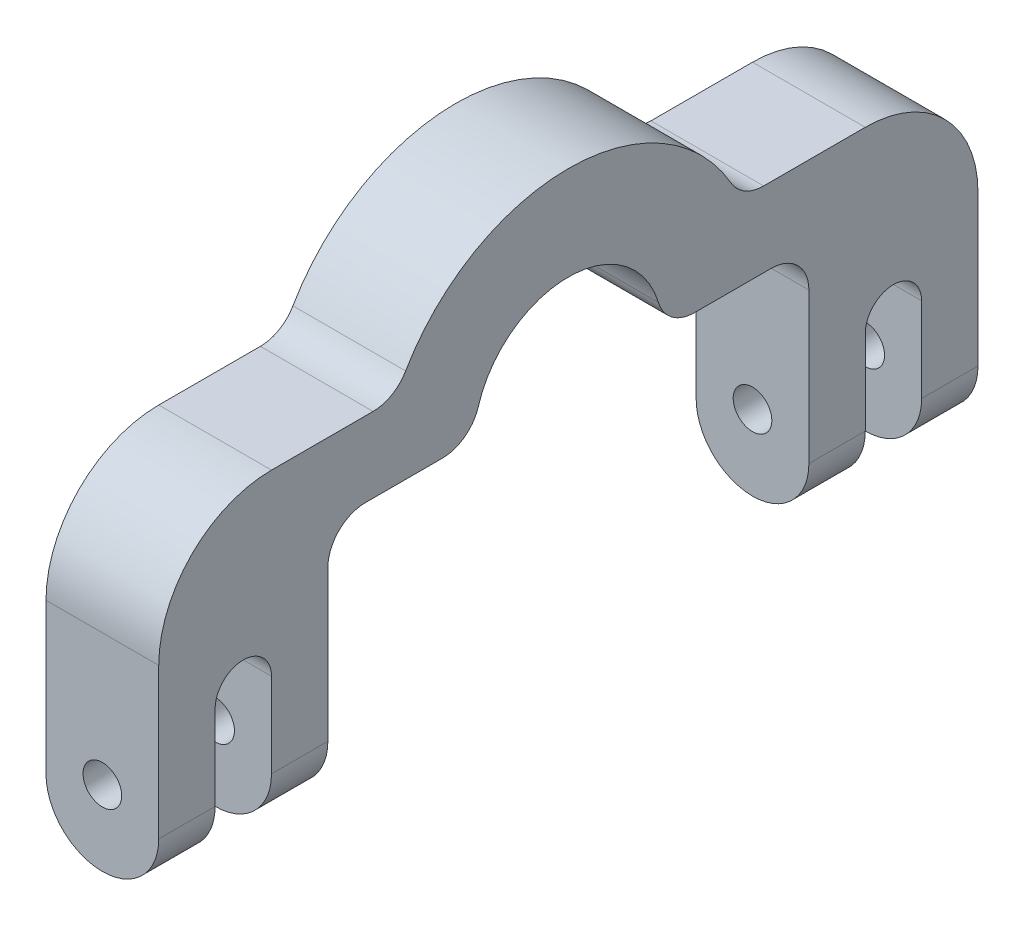
ISO-10303-21;
HEADER;
FILE_DESCRIPTION(('STEP AP214'),'2;1');
FILE_NAME('part.step','',(''),(''),'','','');
FILE_SCHEMA(('AUTOMOTIVE_DESIGN { 1 0 10303 214 1 1 1 1 }'));
ENDSEC;
DATA;
#1=APPLICATION_CONTEXT('core data for automotive mechanical design processes');
#2=APPLICATION_PROTOCOL_DEFINITION('international standard','automotive_design',2000,#1);
#3=PRODUCT_CONTEXT('',#1,'mechanical');
#4=PRODUCT('Part','Part','',(#3));
#5=PRODUCT_RELATED_PRODUCT_CATEGORY('part','',(#4));
#6=PRODUCT_DEFINITION_FORMATION('','',#4);
#7=PRODUCT_DEFINITION_CONTEXT('part definition',#1,'design');
#8=PRODUCT_DEFINITION('design','',#6,#7);
#9=PRODUCT_DEFINITION_SHAPE('','',#8);
#10=(LENGTH_UNIT() NAMED_UNIT(*) SI_UNIT(.MILLI.,.METRE.));
#11=(NAMED_UNIT(*) PLANE_ANGLE_UNIT() SI_UNIT($,.RADIAN.));
#12=(NAMED_UNIT(*) SI_UNIT($,.STERADIAN.) SOLID_ANGLE_UNIT());
#13=UNCERTAINTY_MEASURE_WITH_UNIT(LENGTH_MEASURE(1.E-05),#10,'distance_accuracy_value','');
#14=(GEOMETRIC_REPRESENTATION_CONTEXT(3) GLOBAL_UNCERTAINTY_ASSIGNED_CONTEXT((#13)) GLOBAL_UNIT_ASSIGNED_CONTEXT((#10,
#11,#12)) REPRESENTATION_CONTEXT('',''));
#15=CARTESIAN_POINT('',(0.,0.,0.));
#16=DIRECTION('',(0.,0.,1.));
#17=DIRECTION('',(1.,0.,0.));
#18=AXIS2_PLACEMENT_3D('',#15,#16,#17);
#19=CARTESIAN_POINT('',(0.,0.,-46.0551252995982));
#20=DIRECTION('',(0.,-1.,0.));
#21=DIRECTION('',(0.,0.,-1.));
#22=AXIS2_PLACEMENT_3D('',#19,#20,#21);
#23=PLANE('',#22);
#24=DIRECTION('',(0.,0.,1.));
#25=VECTOR('',#24,1.);
#26=CARTESIAN_POINT('',(-4.7625,0.,-46.0551252995982));
#27=LINE('',#26,#25);
#28=CARTESIAN_POINT('',(-4.7625,0.,10.6492737428427));
#29=VERTEX_POINT('',#28);
#30=CARTESIAN_POINT('',(-4.7625,0.,17.145));
#31=VERTEX_POINT('',#30);
#32=EDGE_CURVE('E260',#29,#31,#27,.T.);
#33=ORIENTED_EDGE('',*,*,#32,.F.);
#34=DIRECTION('',(1.,0.,0.));
#35=VECTOR('',#34,1.);
#36=CARTESIAN_POINT('',(4.7625,0.,10.6492737428427));
#37=LINE('',#36,#35);
#38=CARTESIAN_POINT('',(4.7625,0.,10.6492737428427));
#39=VERTEX_POINT('',#38);
#40=EDGE_CURVE('E369',#29,#39,#37,.T.);
#41=ORIENTED_EDGE('',*,*,#40,.T.);
#42=DIRECTION('',(0.,0.,1.));
#43=VECTOR('',#42,1.);
#44=CARTESIAN_POINT('',(4.7625,0.,-46.0551252995982));
#45=LINE('',#44,#43);
#46=CARTESIAN_POINT('',(4.7625,0.,17.145));
#47=VERTEX_POINT('',#46);
#48=EDGE_CURVE('E265',#39,#47,#45,.T.);
#49=ORIENTED_EDGE('',*,*,#48,.T.);
#50=DIRECTION('',(-1.,0.,0.));
#51=VECTOR('',#50,1.);
#52=CARTESIAN_POINT('',(0.,0.,17.145));
#53=LINE('',#52,#51);
#54=EDGE_CURVE('E314',#47,#31,#53,.T.);
#55=ORIENTED_EDGE('',*,*,#54,.T.);
#56=EDGE_LOOP('',(#33,#41,#49,#55));
#57=FACE_BOUND('',#56,.T.);
#58=ADVANCED_FACE('F34',(#57),#23,.T.);
#59=CARTESIAN_POINT('',(0.,6.35,-46.0551252995982));
#60=DIRECTION('',(0.,1.,0.));
#61=DIRECTION('',(-1.,0.,0.));
#62=AXIS2_PLACEMENT_3D('',#59,#60,#61);
#63=PLANE('',#62);
#64=DIRECTION('',(0.,0.,1.));
#65=VECTOR('',#64,1.);
#66=CARTESIAN_POINT('',(4.7625,6.35,-46.0551252995982));
#67=LINE('',#66,#65);
#68=CARTESIAN_POINT('',(4.7625,6.35,-25.0825));
#69=VERTEX_POINT('',#68);
#70=CARTESIAN_POINT('',(4.7625,6.35,-16.4977839420936));
#71=VERTEX_POINT('',#70);
#72=EDGE_CURVE('E268',#69,#71,#67,.T.);
#73=ORIENTED_EDGE('',*,*,#72,.F.);
#74=DIRECTION('',(-1.,0.,0.));
#75=VECTOR('',#74,1.);
#76=CARTESIAN_POINT('',(0.,6.35,-25.0825));
#77=LINE('',#76,#75);
#78=CARTESIAN_POINT('',(-4.7625,6.35,-25.0825));
#79=VERTEX_POINT('',#78);
#80=EDGE_CURVE('E43',#69,#79,#77,.T.);
#81=ORIENTED_EDGE('',*,*,#80,.T.);
#82=DIRECTION('',(0.,0.,1.));
#83=VECTOR('',#82,1.);
#84=CARTESIAN_POINT('',(-4.7625,6.35,-46.0551252995982));
#85=LINE('',#84,#83);
#86=CARTESIAN_POINT('',(-4.7625,6.35,-16.4977839420936));
#87=VERTEX_POINT('',#86);
#88=EDGE_CURVE('E261',#79,#87,#85,.T.);
#89=ORIENTED_EDGE('',*,*,#88,.T.);
#90=DIRECTION('',(1.,0.,0.));
#91=VECTOR('',#90,1.);
#92=CARTESIAN_POINT('',(4.7625,6.35,-16.4977839420936));
#93=LINE('',#92,#91);
#94=EDGE_CURVE('E357',#87,#71,#93,.T.);
#95=ORIENTED_EDGE('',*,*,#94,.T.);
#96=EDGE_LOOP('',(#73,#81,#89,#95));
#97=FACE_BOUND('',#96,.T.);
#98=ADVANCED_FACE('F403',(#97),#63,.T.);
#99=CARTESIAN_POINT('',(4.7625,-8.73125,27.46375));
#100=DIRECTION('',(-1.,0.,0.));
#101=DIRECTION('',(0.,0.,1.));
#102=AXIS2_PLACEMENT_3D('',#99,#100,#101);
#103=CYLINDRICAL_SURFACE('',#102,2.38125);
#104=DIRECTION('',(-1.,0.,0.));
#105=VECTOR('',#104,1.);
#106=CARTESIAN_POINT('',(0.,-8.73125,25.0825));
#107=LINE('',#106,#105);
#108=CARTESIAN_POINT('',(4.7625,-8.73125,25.0825));
#109=VERTEX_POINT('',#108);
#110=CARTESIAN_POINT('',(-4.7625,-8.73125,25.0825));
#111=VERTEX_POINT('',#110);
#112=EDGE_CURVE('E339',#109,#111,#107,.T.);
#113=ORIENTED_EDGE('',*,*,#112,.F.);
#114=CARTESIAN_POINT('',(4.7625,-8.73125,27.46375));
#115=DIRECTION('',(-1.,0.,0.));
#116=DIRECTION('',(0.,-1.,0.));
#117=AXIS2_PLACEMENT_3D('',#114,#115,#116);
#118=CIRCLE('',#117,2.38125);
#119=CARTESIAN_POINT('',(4.7625,-8.73125,29.845));
#120=VERTEX_POINT('',#119);
#121=EDGE_CURVE('E345',#109,#120,#118,.F.);
#122=ORIENTED_EDGE('',*,*,#121,.T.);
#123=DIRECTION('',(1.,0.,0.));
#124=VECTOR('',#123,1.);
#125=CARTESIAN_POINT('',(4.7625,-8.73125,29.845));
#126=LINE('',#125,#124);
#127=CARTESIAN_POINT('',(-4.7625,-8.73125,29.845));
#128=VERTEX_POINT('',#127);
#129=EDGE_CURVE('E342',#128,#120,#126,.T.);
#130=ORIENTED_EDGE('',*,*,#129,.F.);
#131=CARTESIAN_POINT('',(-4.7625,-8.73125,27.46375));
#132=DIRECTION('',(1.,0.,0.));
#133=DIRECTION('',(0.,1.,0.));
#134=AXIS2_PLACEMENT_3D('',#131,#132,#133);
#135=CIRCLE('',#134,2.38125);
#136=EDGE_CURVE('E347',#128,#111,#135,.F.);
#137=ORIENTED_EDGE('',*,*,#136,.T.);
#138=EDGE_LOOP('',(#113,#122,#130,#137));
#139=FACE_BOUND('',#138,.T.);
#140=ADVANCED_FACE('F474',(#139),#103,.F.);
#141=CARTESIAN_POINT('',(4.7625,-8.73125,-27.46375));
#142=DIRECTION('',(-1.,0.,0.));
#143=DIRECTION('',(0.,0.,1.));
#144=AXIS2_PLACEMENT_3D('',#141,#142,#143);
#145=CYLINDRICAL_SURFACE('',#144,2.38125);
#146=DIRECTION('',(1.,0.,0.));
#147=VECTOR('',#146,1.);
#148=CARTESIAN_POINT('',(4.7625,-8.73125,-29.845));
#149=LINE('',#148,#147);
#150=CARTESIAN_POINT('',(4.7625,-8.73125,-29.845));
#151=VERTEX_POINT('',#150);
#152=CARTESIAN_POINT('',(-4.7625,-8.73125,-29.845));
#153=VERTEX_POINT('',#152);
#154=EDGE_CURVE('E329',#151,#153,#149,.F.);
#155=ORIENTED_EDGE('',*,*,#154,.F.);
#156=CARTESIAN_POINT('',(4.7625,-8.73125,-27.46375));
#157=DIRECTION('',(-1.,0.,0.));
#158=DIRECTION('',(0.,-1.,0.));
#159=AXIS2_PLACEMENT_3D('',#156,#157,#158);
#160=CIRCLE('',#159,2.38125);
#161=CARTESIAN_POINT('',(4.7625,-8.73125,-25.0825));
#162=VERTEX_POINT('',#161);
#163=EDGE_CURVE('E335',#151,#162,#160,.F.);
#164=ORIENTED_EDGE('',*,*,#163,.T.);
#165=DIRECTION('',(-1.,0.,0.));
#166=VECTOR('',#165,1.);
#167=CARTESIAN_POINT('',(0.,-8.73125,-25.0825));
#168=LINE('',#167,#166);
#169=CARTESIAN_POINT('',(-4.7625,-8.73125,-25.0825));
#170=VERTEX_POINT('',#169);
#171=EDGE_CURVE('E332',#170,#162,#168,.F.);
#172=ORIENTED_EDGE('',*,*,#171,.F.);
#173=CARTESIAN_POINT('',(-4.7625,-8.73125,-27.46375));
#174=DIRECTION('',(1.,0.,0.));
#175=DIRECTION('',(0.,1.,0.));
#176=AXIS2_PLACEMENT_3D('',#173,#174,#175);
#177=CIRCLE('',#176,2.38125);
#178=EDGE_CURVE('E337',#170,#153,#177,.F.);
#179=ORIENTED_EDGE('',*,*,#178,.T.);
#180=EDGE_LOOP('',(#155,#164,#172,#179));
#181=FACE_BOUND('',#180,.T.);
#182=ADVANCED_FACE('F556',(#181),#145,.F.);
#183=CARTESIAN_POINT('',(4.7625,0.,34.6075));
#184=DIRECTION('',(-1.,0.,0.));
#185=DIRECTION('',(0.,-1.,0.));
#186=AXIS2_PLACEMENT_3D('',#183,#184,#185);
#187=PLANE('',#186);
#188=CARTESIAN_POINT('',(4.7625,6.35,16.4977839420936));
#189=VERTEX_POINT('',#188);
#190=CARTESIAN_POINT('',(4.7625,6.35,25.0825));
#191=VERTEX_POINT('',#190);
#192=EDGE_CURVE('E257',#189,#191,#67,.T.);
#193=ORIENTED_EDGE('',*,*,#192,.T.);
#194=CARTESIAN_POINT('',(4.7625,-3.175,25.0825));
#195=DIRECTION('',(-1.,0.,0.));
#196=DIRECTION('',(0.,-1.,0.));
#197=AXIS2_PLACEMENT_3D('',#194,#195,#196);
#198=CIRCLE('',#197,9.525);
#199=CARTESIAN_POINT('',(4.7625,-3.175,34.6075));
#200=VERTEX_POINT('',#199);
#201=EDGE_CURVE('E397',#191,#200,#198,.F.);
#202=ORIENTED_EDGE('',*,*,#201,.T.);
#203=DIRECTION('',(0.,1.,0.));
#204=VECTOR('',#203,1.);
#205=CARTESIAN_POINT('',(4.7625,0.,34.6075));
#206=LINE('',#205,#204);
#207=CARTESIAN_POINT('',(4.7625,-15.875,34.6075));
#208=VERTEX_POINT('',#207);
#209=EDGE_CURVE('E279',#208,#200,#206,.T.);
#210=ORIENTED_EDGE('',*,*,#209,.F.);
#211=DIRECTION('',(0.,0.,-1.));
#212=VECTOR('',#211,1.);
#213=CARTESIAN_POINT('',(4.7625,-15.875,34.6075));
#214=LINE('',#213,#212);
#215=CARTESIAN_POINT('',(4.7625,-15.875,29.845));
#216=VERTEX_POINT('',#215);
#217=EDGE_CURVE('E290',#208,#216,#214,.T.);
#218=ORIENTED_EDGE('',*,*,#217,.T.);
#219=DIRECTION('',(0.,1.,0.));
#220=VECTOR('',#219,1.);
#221=CARTESIAN_POINT('',(4.7625,-6.35,29.845));
#222=LINE('',#221,#220);
#223=EDGE_CURVE('E287',#216,#120,#222,.T.);
#224=ORIENTED_EDGE('',*,*,#223,.T.);
#225=ORIENTED_EDGE('',*,*,#121,.F.);
#226=DIRECTION('',(0.,1.,0.));
#227=VECTOR('',#226,1.);
#228=CARTESIAN_POINT('',(4.7625,-6.35,25.0825));
#229=LINE('',#228,#227);
#230=CARTESIAN_POINT('',(4.7625,-15.875,25.0825));
#231=VERTEX_POINT('',#230);
#232=EDGE_CURVE('E297',#231,#109,#229,.T.);
#233=ORIENTED_EDGE('',*,*,#232,.F.);
#234=CARTESIAN_POINT('',(4.7625,-15.875,20.32));
#235=VERTEX_POINT('',#234);
#236=EDGE_CURVE('E273',#231,#235,#214,.T.);
#237=ORIENTED_EDGE('',*,*,#236,.T.);
#238=DIRECTION('',(0.,1.,0.));
#239=VECTOR('',#238,1.);
#240=CARTESIAN_POINT('',(4.7625,-15.875,20.32));
#241=LINE('',#240,#239);
#242=CARTESIAN_POINT('',(4.7625,-3.175,20.32));
#243=VERTEX_POINT('',#242);
#244=EDGE_CURVE('E302',#235,#243,#241,.T.);
#245=ORIENTED_EDGE('',*,*,#244,.T.);
#246=CARTESIAN_POINT('',(4.7625,-3.175,17.145));
#247=DIRECTION('',(-1.,0.,0.));
#248=DIRECTION('',(0.,-1.,0.));
#249=AXIS2_PLACEMENT_3D('',#246,#247,#248);
#250=CIRCLE('',#249,3.175);
#251=EDGE_CURVE('E323',#243,#47,#250,.T.);
#252=ORIENTED_EDGE('',*,*,#251,.T.);
#253=ORIENTED_EDGE('',*,*,#48,.F.);
#254=CARTESIAN_POINT('',(4.7625,3.175,10.6492737428427));
#255=DIRECTION('',(-1.,0.,0.));
#256=DIRECTION('',(0.,-1.,0.));
#257=AXIS2_PLACEMENT_3D('',#254,#255,#256);
#258=CIRCLE('',#257,3.175);
#259=CARTESIAN_POINT('',(4.7625,2.26785714285714,7.60662410203053));
#260=VERTEX_POINT('',#259);
#261=EDGE_CURVE('E373',#39,#260,#258,.F.);
#262=ORIENTED_EDGE('',*,*,#261,.T.);
#263=CARTESIAN_POINT('',(4.7625,0.,0.));
#264=DIRECTION('',(-1.,0.,0.));
#265=DIRECTION('',(0.,0.,-1.));
#266=AXIS2_PLACEMENT_3D('',#263,#264,#265);
#267=CIRCLE('',#266,7.9375);
#268=CARTESIAN_POINT('',(4.7625,2.26785714285714,-7.60662410203053));
#269=VERTEX_POINT('',#268);
#270=EDGE_CURVE('E425',#260,#269,#267,.T.);
#271=ORIENTED_EDGE('',*,*,#270,.T.);
#272=CARTESIAN_POINT('',(4.7625,3.175,-10.6492737428427));
#273=DIRECTION('',(-1.,0.,0.));
#274=DIRECTION('',(0.,-1.,0.));
#275=AXIS2_PLACEMENT_3D('',#272,#273,#274);
#276=CIRCLE('',#275,3.175);
#277=CARTESIAN_POINT('',(4.7625,0.,-10.6492737428427));
#278=VERTEX_POINT('',#277);
#279=EDGE_CURVE('E371',#269,#278,#276,.F.);
#280=ORIENTED_EDGE('',*,*,#279,.T.);
#281=CARTESIAN_POINT('',(4.7625,0.,-17.145));
#282=VERTEX_POINT('',#281);
#283=EDGE_CURVE('E270',#282,#278,#45,.T.);
#284=ORIENTED_EDGE('',*,*,#283,.F.);
#285=CARTESIAN_POINT('',(4.7625,-3.175,-17.145));
#286=DIRECTION('',(-1.,0.,0.));
#287=DIRECTION('',(0.,-1.,0.));
#288=AXIS2_PLACEMENT_3D('',#285,#286,#287);
#289=CIRCLE('',#288,3.175);
#290=CARTESIAN_POINT('',(4.7625,-3.175,-20.32));
#291=VERTEX_POINT('',#290);
#292=EDGE_CURVE('E226',#282,#291,#289,.T.);
#293=ORIENTED_EDGE('',*,*,#292,.T.);
#294=DIRECTION('',(0.,-1.,0.));
#295=VECTOR('',#294,1.);
#296=CARTESIAN_POINT('',(4.7625,-15.875,-20.32));
#297=LINE('',#296,#295);
#298=CARTESIAN_POINT('',(4.7625,-15.875,-20.32));
#299=VERTEX_POINT('',#298);
#300=EDGE_CURVE('E217',#291,#299,#297,.T.);
#301=ORIENTED_EDGE('',*,*,#300,.T.);
#302=DIRECTION('',(0.,0.,-1.));
#303=VECTOR('',#302,1.);
#304=CARTESIAN_POINT('',(4.7625,-15.875,34.6075));
#305=LINE('',#304,#303);
#306=CARTESIAN_POINT('',(4.7625,-15.875,-25.0825));
#307=VERTEX_POINT('',#306);
#308=EDGE_CURVE('E223',#299,#307,#305,.T.);
#309=ORIENTED_EDGE('',*,*,#308,.T.);
#310=DIRECTION('',(0.,1.,0.));
#311=VECTOR('',#310,1.);
#312=CARTESIAN_POINT('',(4.7625,-6.35,-25.0825));
#313=LINE('',#312,#311);
#314=EDGE_CURVE('E432',#307,#162,#313,.T.);
#315=ORIENTED_EDGE('',*,*,#314,.T.);
#316=ORIENTED_EDGE('',*,*,#163,.F.);
#317=DIRECTION('',(0.,1.,0.));
#318=VECTOR('',#317,1.);
#319=CARTESIAN_POINT('',(4.7625,-6.35,-29.845));
#320=LINE('',#319,#318);
#321=CARTESIAN_POINT('',(4.7625,-15.875,-29.845));
#322=VERTEX_POINT('',#321);
#323=EDGE_CURVE('E438',#322,#151,#320,.T.);
#324=ORIENTED_EDGE('',*,*,#323,.F.);
#325=CARTESIAN_POINT('',(4.7625,-15.875,-34.6075));
#326=VERTEX_POINT('',#325);
#327=EDGE_CURVE('E245',#322,#326,#305,.T.);
#328=ORIENTED_EDGE('',*,*,#327,.T.);
#329=DIRECTION('',(0.,1.,0.));
#330=VECTOR('',#329,1.);
#331=CARTESIAN_POINT('',(4.7625,-15.875,-34.6075));
#332=LINE('',#331,#330);
#333=CARTESIAN_POINT('',(4.7625,-3.175,-34.6075));
#334=VERTEX_POINT('',#333);
#335=EDGE_CURVE('E255',#326,#334,#332,.T.);
#336=ORIENTED_EDGE('',*,*,#335,.T.);
#337=CARTESIAN_POINT('',(4.7625,-3.175,-25.0825));
#338=DIRECTION('',(-1.,0.,0.));
#339=DIRECTION('',(0.,-1.,0.));
#340=AXIS2_PLACEMENT_3D('',#337,#338,#339);
#341=CIRCLE('',#340,9.525);
#342=EDGE_CURVE('E50',#334,#69,#341,.F.);
#343=ORIENTED_EDGE('',*,*,#342,.T.);
#344=ORIENTED_EDGE('',*,*,#72,.T.);
#345=CARTESIAN_POINT('',(4.7625,9.52500000000001,-16.4977839420936));
#346=DIRECTION('',(-1.,0.,0.));
#347=DIRECTION('',(0.,-1.,0.));
#348=AXIS2_PLACEMENT_3D('',#345,#346,#347);
#349=CIRCLE('',#348,3.175);
#350=CARTESIAN_POINT('',(4.7625,7.9375,-13.748153285078));
#351=VERTEX_POINT('',#350);
#352=EDGE_CURVE('E385',#71,#351,#349,.T.);
#353=ORIENTED_EDGE('',*,*,#352,.T.);
#354=CARTESIAN_POINT('',(4.7625,0.,0.));
#355=DIRECTION('',(-1.,0.,0.));
#356=DIRECTION('',(0.,-1.,0.));
#357=AXIS2_PLACEMENT_3D('',#354,#355,#356);
#358=CIRCLE('',#357,15.875);
#359=CARTESIAN_POINT('',(4.7625,7.9375,13.748153285078));
#360=VERTEX_POINT('',#359);
#361=EDGE_CURVE('E418',#351,#360,#358,.F.);
#362=ORIENTED_EDGE('',*,*,#361,.T.);
#363=CARTESIAN_POINT('',(4.7625,9.52500000000001,16.4977839420936));
#364=DIRECTION('',(-1.,0.,0.));
#365=DIRECTION('',(0.,-1.,0.));
#366=AXIS2_PLACEMENT_3D('',#363,#364,#365);
#367=CIRCLE('',#366,3.175);
#368=EDGE_CURVE('E380',#360,#189,#367,.T.);
#369=ORIENTED_EDGE('',*,*,#368,.T.);
#370=EDGE_LOOP('',(#193,#202,#210,#218,#224,#225,#233,#237,#245,#252,#253,#262,#271,#280,#284,
#293,#301,#309,#315,#316,#324,#328,#336,#343,#344,#353,#362,#369));
#371=FACE_BOUND('',#370,.T.);
#372=ADVANCED_FACE('F220',(#371),#187,.F.);
#373=CARTESIAN_POINT('',(-4.7625,0.,34.6075));
#374=DIRECTION('',(1.,0.,0.));
#375=DIRECTION('',(0.,1.,0.));
#376=AXIS2_PLACEMENT_3D('',#373,#374,#375);
#377=PLANE('',#376);
#378=DIRECTION('',(0.,-1.,0.));
#379=VECTOR('',#378,1.);
#380=CARTESIAN_POINT('',(-4.7625,0.,34.6075));
#381=LINE('',#380,#379);
#382=CARTESIAN_POINT('',(-4.7625,-3.175,34.6075));
#383=VERTEX_POINT('',#382);
#384=CARTESIAN_POINT('',(-4.7625,-15.875,34.6075));
#385=VERTEX_POINT('',#384);
#386=EDGE_CURVE('E277',#383,#385,#381,.T.);
#387=ORIENTED_EDGE('',*,*,#386,.F.);
#388=CARTESIAN_POINT('',(-4.7625,-3.175,25.0825));
#389=DIRECTION('',(1.,0.,0.));
#390=DIRECTION('',(0.,1.,0.));
#391=AXIS2_PLACEMENT_3D('',#388,#389,#390);
#392=CIRCLE('',#391,9.525);
#393=CARTESIAN_POINT('',(-4.7625,6.35,25.0825));
#394=VERTEX_POINT('',#393);
#395=EDGE_CURVE('E392',#383,#394,#392,.F.);
#396=ORIENTED_EDGE('',*,*,#395,.T.);
#397=CARTESIAN_POINT('',(-4.7625,6.35,16.4977839420936));
#398=VERTEX_POINT('',#397);
#399=EDGE_CURVE('E267',#398,#394,#85,.T.);
#400=ORIENTED_EDGE('',*,*,#399,.F.);
#401=CARTESIAN_POINT('',(-4.7625,9.52500000000001,16.4977839420936));
#402=DIRECTION('',(1.,0.,0.));
#403=DIRECTION('',(0.,1.,0.));
#404=AXIS2_PLACEMENT_3D('',#401,#402,#403);
#405=CIRCLE('',#404,3.175);
#406=CARTESIAN_POINT('',(-4.7625,7.9375,13.748153285078));
#407=VERTEX_POINT('',#406);
#408=EDGE_CURVE('E378',#398,#407,#405,.T.);
#409=ORIENTED_EDGE('',*,*,#408,.T.);
#410=CARTESIAN_POINT('',(-4.7625,0.,0.));
#411=DIRECTION('',(-1.,0.,0.));
#412=DIRECTION('',(0.,0.,-1.));
#413=AXIS2_PLACEMENT_3D('',#410,#411,#412);
#414=CIRCLE('',#413,15.875);
#415=CARTESIAN_POINT('',(-4.7625,7.9375,-13.748153285078));
#416=VERTEX_POINT('',#415);
#417=EDGE_CURVE('E411',#407,#416,#414,.T.);
#418=ORIENTED_EDGE('',*,*,#417,.T.);
#419=CARTESIAN_POINT('',(-4.7625,9.52500000000001,-16.4977839420936));
#420=DIRECTION('',(1.,0.,0.));
#421=DIRECTION('',(0.,1.,0.));
#422=AXIS2_PLACEMENT_3D('',#419,#420,#421);
#423=CIRCLE('',#422,3.175);
#424=EDGE_CURVE('E382',#416,#87,#423,.T.);
#425=ORIENTED_EDGE('',*,*,#424,.T.);
#426=ORIENTED_EDGE('',*,*,#88,.F.);
#427=CARTESIAN_POINT('',(-4.7625,-3.175,-25.0825));
#428=DIRECTION('',(1.,0.,0.));
#429=DIRECTION('',(0.,1.,0.));
#430=AXIS2_PLACEMENT_3D('',#427,#428,#429);
#431=CIRCLE('',#430,9.525);
#432=CARTESIAN_POINT('',(-4.7625,-3.175,-34.6075));
#433=VERTEX_POINT('',#432);
#434=EDGE_CURVE('E390',#79,#433,#431,.F.);
#435=ORIENTED_EDGE('',*,*,#434,.T.);
#436=DIRECTION('',(0.,-1.,0.));
#437=VECTOR('',#436,1.);
#438=CARTESIAN_POINT('',(-4.7625,-15.875,-34.6075));
#439=LINE('',#438,#437);
#440=CARTESIAN_POINT('',(-4.7625,-15.875,-34.6075));
#441=VERTEX_POINT('',#440);
#442=EDGE_CURVE('E258',#433,#441,#439,.T.);
#443=ORIENTED_EDGE('',*,*,#442,.T.);
#444=DIRECTION('',(0.,0.,-1.));
#445=VECTOR('',#444,1.);
#446=CARTESIAN_POINT('',(-4.7625,-15.875,34.6075));
#447=LINE('',#446,#445);
#448=CARTESIAN_POINT('',(-4.7625,-15.875,-29.845));
#449=VERTEX_POINT('',#448);
#450=EDGE_CURVE('E244',#449,#441,#447,.T.);
#451=ORIENTED_EDGE('',*,*,#450,.F.);
#452=DIRECTION('',(0.,-1.,0.));
#453=VECTOR('',#452,1.);
#454=CARTESIAN_POINT('',(-4.7625,-15.875,-29.845));
#455=LINE('',#454,#453);
#456=EDGE_CURVE('E433',#153,#449,#455,.T.);
#457=ORIENTED_EDGE('',*,*,#456,.F.);
#458=ORIENTED_EDGE('',*,*,#178,.F.);
#459=DIRECTION('',(0.,-1.,0.));
#460=VECTOR('',#459,1.);
#461=CARTESIAN_POINT('',(-4.7625,-15.875,-25.0825));
#462=LINE('',#461,#460);
#463=CARTESIAN_POINT('',(-4.7625,-15.875,-25.0825));
#464=VERTEX_POINT('',#463);
#465=EDGE_CURVE('E435',#170,#464,#462,.T.);
#466=ORIENTED_EDGE('',*,*,#465,.T.);
#467=CARTESIAN_POINT('',(-4.7625,-15.875,-20.32));
#468=VERTEX_POINT('',#467);
#469=EDGE_CURVE('E248',#468,#464,#447,.T.);
#470=ORIENTED_EDGE('',*,*,#469,.F.);
#471=DIRECTION('',(0.,1.,0.));
#472=VECTOR('',#471,1.);
#473=CARTESIAN_POINT('',(-4.7625,0.,-20.32));
#474=LINE('',#473,#472);
#475=CARTESIAN_POINT('',(-4.7625,-3.175,-20.32));
#476=VERTEX_POINT('',#475);
#477=EDGE_CURVE('E235',#468,#476,#474,.T.);
#478=ORIENTED_EDGE('',*,*,#477,.T.);
#479=CARTESIAN_POINT('',(-4.7625,-3.175,-17.145));
#480=DIRECTION('',(1.,0.,0.));
#481=DIRECTION('',(0.,1.,0.));
#482=AXIS2_PLACEMENT_3D('',#479,#480,#481);
#483=CIRCLE('',#482,3.175);
#484=CARTESIAN_POINT('',(-4.7625,0.,-17.145));
#485=VERTEX_POINT('',#484);
#486=EDGE_CURVE('E327',#476,#485,#483,.T.);
#487=ORIENTED_EDGE('',*,*,#486,.T.);
#488=CARTESIAN_POINT('',(-4.7625,0.,-10.6492737428427));
#489=VERTEX_POINT('',#488);
#490=EDGE_CURVE('E262',#485,#489,#27,.T.);
#491=ORIENTED_EDGE('',*,*,#490,.T.);
#492=CARTESIAN_POINT('',(-4.7625,3.175,-10.6492737428427));
#493=DIRECTION('',(1.,0.,0.));
#494=DIRECTION('',(0.,1.,0.));
#495=AXIS2_PLACEMENT_3D('',#492,#493,#494);
#496=CIRCLE('',#495,3.175);
#497=CARTESIAN_POINT('',(-4.7625,2.26785714285714,-7.60662410203053));
#498=VERTEX_POINT('',#497);
#499=EDGE_CURVE('E365',#489,#498,#496,.F.);
#500=ORIENTED_EDGE('',*,*,#499,.T.);
#501=CARTESIAN_POINT('',(-4.7625,0.,0.));
#502=DIRECTION('',(-1.,0.,0.));
#503=DIRECTION('',(0.,0.,-1.));
#504=AXIS2_PLACEMENT_3D('',#501,#502,#503);
#505=CIRCLE('',#504,7.9375);
#506=CARTESIAN_POINT('',(-4.7625,2.26785714285714,7.60662410203053));
#507=VERTEX_POINT('',#506);
#508=EDGE_CURVE('E428',#507,#498,#505,.T.);
#509=ORIENTED_EDGE('',*,*,#508,.F.);
#510=CARTESIAN_POINT('',(-4.7625,3.175,10.6492737428427));
#511=DIRECTION('',(1.,0.,0.));
#512=DIRECTION('',(0.,1.,0.));
#513=AXIS2_PLACEMENT_3D('',#510,#511,#512);
#514=CIRCLE('',#513,3.175);
#515=EDGE_CURVE('E367',#507,#29,#514,.F.);
#516=ORIENTED_EDGE('',*,*,#515,.T.);
#517=ORIENTED_EDGE('',*,*,#32,.T.);
#518=CARTESIAN_POINT('',(-4.7625,-3.175,17.145));
#519=DIRECTION('',(1.,0.,0.));
#520=DIRECTION('',(0.,1.,0.));
#521=AXIS2_PLACEMENT_3D('',#518,#519,#520);
#522=CIRCLE('',#521,3.175);
#523=CARTESIAN_POINT('',(-4.7625,-3.175,20.32));
#524=VERTEX_POINT('',#523);
#525=EDGE_CURVE('E321',#31,#524,#522,.T.);
#526=ORIENTED_EDGE('',*,*,#525,.T.);
#527=DIRECTION('',(0.,-1.,0.));
#528=VECTOR('',#527,1.);
#529=CARTESIAN_POINT('',(-4.7625,0.,20.32));
#530=LINE('',#529,#528);
#531=CARTESIAN_POINT('',(-4.7625,-15.875,20.32));
#532=VERTEX_POINT('',#531);
#533=EDGE_CURVE('E286',#524,#532,#530,.T.);
#534=ORIENTED_EDGE('',*,*,#533,.T.);
#535=DIRECTION('',(0.,0.,-1.));
#536=VECTOR('',#535,1.);
#537=CARTESIAN_POINT('',(-4.7625,-15.875,34.6075));
#538=LINE('',#537,#536);
#539=CARTESIAN_POINT('',(-4.7625,-15.875,25.0825));
#540=VERTEX_POINT('',#539);
#541=EDGE_CURVE('E285',#540,#532,#538,.T.);
#542=ORIENTED_EDGE('',*,*,#541,.F.);
#543=DIRECTION('',(0.,-1.,0.));
#544=VECTOR('',#543,1.);
#545=CARTESIAN_POINT('',(-4.7625,-15.875,25.0825));
#546=LINE('',#545,#544);
#547=EDGE_CURVE('E294',#111,#540,#546,.T.);
#548=ORIENTED_EDGE('',*,*,#547,.F.);
#549=ORIENTED_EDGE('',*,*,#136,.F.);
#550=DIRECTION('',(0.,-1.,0.));
#551=VECTOR('',#550,1.);
#552=CARTESIAN_POINT('',(-4.7625,-15.875,29.845));
#553=LINE('',#552,#551);
#554=CARTESIAN_POINT('',(-4.7625,-15.875,29.845));
#555=VERTEX_POINT('',#554);
#556=EDGE_CURVE('E283',#128,#555,#553,.T.);
#557=ORIENTED_EDGE('',*,*,#556,.T.);
#558=EDGE_CURVE('E293',#385,#555,#538,.T.);
#559=ORIENTED_EDGE('',*,*,#558,.F.);
#560=EDGE_LOOP('',(#387,#396,#400,#409,#418,#425,#426,#435,#443,#451,#457,#458,#466,#470,#478,
#487,#491,#500,#509,#516,#517,#526,#534,#542,#548,#549,#557,#559));
#561=FACE_BOUND('',#560,.T.);
#562=ADVANCED_FACE('F407',(#561),#377,.F.);
#563=CARTESIAN_POINT('',(0.,-15.875,34.6075));
#564=DIRECTION('',(0.,0.,-1.));
#565=DIRECTION('',(-1.,0.,0.));
#566=AXIS2_PLACEMENT_3D('',#563,#564,#565);
#567=CYLINDRICAL_SURFACE('',#566,4.7625);
#568=ORIENTED_EDGE('',*,*,#541,.T.);
#569=CARTESIAN_POINT('',(0.,-15.875,20.32));
#570=DIRECTION('',(0.,0.,1.));
#571=DIRECTION('',(1.,0.,0.));
#572=AXIS2_PLACEMENT_3D('',#569,#570,#571);
#573=CIRCLE('',#572,4.7625);
#574=EDGE_CURVE('E305',#532,#235,#573,.T.);
#575=ORIENTED_EDGE('',*,*,#574,.T.);
#576=ORIENTED_EDGE('',*,*,#236,.F.);
#577=CARTESIAN_POINT('',(0.,-15.875,25.0825));
#578=DIRECTION('',(0.,0.,1.));
#579=DIRECTION('',(1.,0.,0.));
#580=AXIS2_PLACEMENT_3D('',#577,#578,#579);
#581=CIRCLE('',#580,4.7625);
#582=EDGE_CURVE('E276',#540,#231,#581,.T.);
#583=ORIENTED_EDGE('',*,*,#582,.F.);
#584=EDGE_LOOP('',(#568,#575,#576,#583));
#585=FACE_BOUND('',#584,.T.);
#586=ADVANCED_FACE('F550',(#585),#567,.T.);
#587=ORIENTED_EDGE('',*,*,#558,.T.);
#588=CARTESIAN_POINT('',(0.,-15.875,29.845));
#589=DIRECTION('',(0.,0.,1.));
#590=DIRECTION('',(1.,0.,0.));
#591=AXIS2_PLACEMENT_3D('',#588,#589,#590);
#592=CIRCLE('',#591,4.7625);
#593=EDGE_CURVE('E282',#555,#216,#592,.T.);
#594=ORIENTED_EDGE('',*,*,#593,.T.);
#595=ORIENTED_EDGE('',*,*,#217,.F.);
#596=CARTESIAN_POINT('',(0.,-15.875,34.6075));
#597=DIRECTION('',(0.,0.,1.));
#598=DIRECTION('',(-1.,0.,0.));
#599=AXIS2_PLACEMENT_3D('',#596,#597,#598);
#600=CIRCLE('',#599,4.7625);
#601=EDGE_CURVE('E274',#385,#208,#600,.T.);
#602=ORIENTED_EDGE('',*,*,#601,.F.);
#603=EDGE_LOOP('',(#587,#594,#595,#602));
#604=FACE_BOUND('',#603,.T.);
#605=ADVANCED_FACE('F541',(#604),#567,.T.);
#606=CARTESIAN_POINT('',(0.,-15.875,34.6075));
#607=DIRECTION('',(0.,0.,-1.));
#608=DIRECTION('',(-1.,0.,0.));
#609=AXIS2_PLACEMENT_3D('',#606,#607,#608);
#610=PLANE('',#609);
#611=CARTESIAN_POINT('',(0.,-14.2875,34.6075));
#612=DIRECTION('',(0.,0.,-1.));
#613=DIRECTION('',(-1.,0.,0.));
#614=AXIS2_PLACEMENT_3D('',#611,#612,#613);
#615=CIRCLE('',#614,1.63194999999999);
#616=CARTESIAN_POINT('',(-1.63194999999999,-14.2875,34.6075));
#617=VERTEX_POINT('',#616);
#618=EDGE_CURVE('E519',#617,#617,#615,.T.);
#619=ORIENTED_EDGE('',*,*,#618,.T.);
#620=EDGE_LOOP('',(#619));
#621=FACE_BOUND('',#620,.T.);
#622=ORIENTED_EDGE('',*,*,#209,.T.);
#623=DIRECTION('',(-1.,0.,0.));
#624=VECTOR('',#623,1.);
#625=CARTESIAN_POINT('',(-4.7625,-3.175,34.6075));
#626=LINE('',#625,#624);
#627=EDGE_CURVE('E387',#200,#383,#626,.T.);
#628=ORIENTED_EDGE('',*,*,#627,.T.);
#629=ORIENTED_EDGE('',*,*,#386,.T.);
#630=ORIENTED_EDGE('',*,*,#601,.T.);
#631=EDGE_LOOP('',(#622,#628,#629,#630));
#632=FACE_BOUND('',#631,.T.);
#633=ADVANCED_FACE('F537',(#621,#632),#610,.F.);
#634=CARTESIAN_POINT('',(0.,-15.875,25.0825));
#635=DIRECTION('',(0.,0.,1.));
#636=DIRECTION('',(1.,0.,0.));
#637=AXIS2_PLACEMENT_3D('',#634,#635,#636);
#638=PLANE('',#637);
#639=CARTESIAN_POINT('',(0.,-14.2875,25.0825));
#640=DIRECTION('',(0.,0.,1.));
#641=DIRECTION('',(1.,0.,0.));
#642=AXIS2_PLACEMENT_3D('',#639,#640,#641);
#643=CIRCLE('',#642,1.63194999999999);
#644=CARTESIAN_POINT('',(1.63194999999999,-14.2875,25.0825));
#645=VERTEX_POINT('',#644);
#646=EDGE_CURVE('E503',#645,#645,#643,.T.);
#647=ORIENTED_EDGE('',*,*,#646,.F.);
#648=EDGE_LOOP('',(#647));
#649=FACE_BOUND('',#648,.T.);
#650=ORIENTED_EDGE('',*,*,#232,.T.);
#651=ORIENTED_EDGE('',*,*,#112,.T.);
#652=ORIENTED_EDGE('',*,*,#547,.T.);
#653=ORIENTED_EDGE('',*,*,#582,.T.);
#654=EDGE_LOOP('',(#650,#651,#652,#653));
#655=FACE_BOUND('',#654,.T.);
#656=ADVANCED_FACE('F540',(#649,#655),#638,.T.);
#657=CARTESIAN_POINT('',(0.,-15.875,29.845));
#658=DIRECTION('',(0.,0.,1.));
#659=DIRECTION('',(1.,0.,0.));
#660=AXIS2_PLACEMENT_3D('',#657,#658,#659);
#661=PLANE('',#660);
#662=CARTESIAN_POINT('',(0.,-14.2875,29.845));
#663=DIRECTION('',(0.,0.,1.));
#664=DIRECTION('',(1.,0.,0.));
#665=AXIS2_PLACEMENT_3D('',#662,#663,#664);
#666=CIRCLE('',#665,1.63194999999999);
#667=CARTESIAN_POINT('',(1.63194999999999,-14.2875,29.845));
#668=VERTEX_POINT('',#667);
#669=EDGE_CURVE('E501',#668,#668,#666,.T.);
#670=ORIENTED_EDGE('',*,*,#669,.T.);
#671=EDGE_LOOP('',(#670));
#672=FACE_BOUND('',#671,.T.);
#673=ORIENTED_EDGE('',*,*,#556,.F.);
#674=ORIENTED_EDGE('',*,*,#129,.T.);
#675=ORIENTED_EDGE('',*,*,#223,.F.);
#676=ORIENTED_EDGE('',*,*,#593,.F.);
#677=EDGE_LOOP('',(#673,#674,#675,#676));
#678=FACE_BOUND('',#677,.T.);
#679=ADVANCED_FACE('F533',(#672,#678),#661,.F.);
#680=CARTESIAN_POINT('',(0.,-15.875,20.32));
#681=DIRECTION('',(0.,0.,1.));
#682=DIRECTION('',(1.,0.,0.));
#683=AXIS2_PLACEMENT_3D('',#680,#681,#682);
#684=PLANE('',#683);
#685=CARTESIAN_POINT('',(0.,-14.2875,20.32));
#686=DIRECTION('',(0.,0.,1.));
#687=DIRECTION('',(1.,0.,0.));
#688=AXIS2_PLACEMENT_3D('',#685,#686,#687);
#689=CIRCLE('',#688,1.63194999999999);
#690=CARTESIAN_POINT('',(1.63194999999999,-14.2875,20.32));
#691=VERTEX_POINT('',#690);
#692=EDGE_CURVE('E516',#691,#691,#689,.T.);
#693=ORIENTED_EDGE('',*,*,#692,.T.);
#694=EDGE_LOOP('',(#693));
#695=FACE_BOUND('',#694,.T.);
#696=ORIENTED_EDGE('',*,*,#533,.F.);
#697=DIRECTION('',(-1.,0.,0.));
#698=VECTOR('',#697,1.);
#699=CARTESIAN_POINT('',(0.,-3.175,20.32));
#700=LINE('',#699,#698);
#701=EDGE_CURVE('E317',#524,#243,#700,.F.);
#702=ORIENTED_EDGE('',*,*,#701,.T.);
#703=ORIENTED_EDGE('',*,*,#244,.F.);
#704=ORIENTED_EDGE('',*,*,#574,.F.);
#705=EDGE_LOOP('',(#696,#702,#703,#704));
#706=FACE_BOUND('',#705,.T.);
#707=ADVANCED_FACE('F528',(#695,#706),#684,.F.);
#708=CARTESIAN_POINT('',(0.,-15.875,-34.6075));
#709=DIRECTION('',(0.,0.,-1.));
#710=DIRECTION('',(-1.,0.,0.));
#711=AXIS2_PLACEMENT_3D('',#708,#709,#710);
#712=PLANE('',#711);
#713=CARTESIAN_POINT('',(0.,-14.2875,-34.6075));
#714=DIRECTION('',(0.,0.,-1.));
#715=DIRECTION('',(-1.,0.,0.));
#716=AXIS2_PLACEMENT_3D('',#713,#714,#715);
#717=CIRCLE('',#716,1.63195);
#718=CARTESIAN_POINT('',(-1.63195,-14.2875,-34.6075));
#719=VERTEX_POINT('',#718);
#720=EDGE_CURVE('E522',#719,#719,#717,.T.);
#721=ORIENTED_EDGE('',*,*,#720,.F.);
#722=EDGE_LOOP('',(#721));
#723=FACE_BOUND('',#722,.T.);
#724=ORIENTED_EDGE('',*,*,#442,.F.);
#725=DIRECTION('',(-1.,0.,0.));
#726=VECTOR('',#725,1.);
#727=CARTESIAN_POINT('',(0.,-3.175,-34.6075));
#728=LINE('',#727,#726);
#729=EDGE_CURVE('E11',#433,#334,#728,.F.);
#730=ORIENTED_EDGE('',*,*,#729,.T.);
#731=ORIENTED_EDGE('',*,*,#335,.F.);
#732=CARTESIAN_POINT('',(0.,-15.875,-34.6075));
#733=DIRECTION('',(0.,0.,1.));
#734=DIRECTION('',(-1.,0.,0.));
#735=AXIS2_PLACEMENT_3D('',#732,#733,#734);
#736=CIRCLE('',#735,4.7625);
#737=EDGE_CURVE('E251',#441,#326,#736,.T.);
#738=ORIENTED_EDGE('',*,*,#737,.F.);
#739=EDGE_LOOP('',(#724,#730,#731,#738));
#740=FACE_BOUND('',#739,.T.);
#741=ADVANCED_FACE('F452',(#723,#740),#712,.T.);
#742=ORIENTED_EDGE('',*,*,#399,.T.);
#743=DIRECTION('',(-1.,0.,0.));
#744=VECTOR('',#743,1.);
#745=CARTESIAN_POINT('',(4.7625,6.35,25.0825));
#746=LINE('',#745,#744);
#747=EDGE_CURVE('E394',#394,#191,#746,.F.);
#748=ORIENTED_EDGE('',*,*,#747,.T.);
#749=ORIENTED_EDGE('',*,*,#192,.F.);
#750=DIRECTION('',(1.,0.,0.));
#751=VECTOR('',#750,1.);
#752=CARTESIAN_POINT('',(-4.7625,6.35,16.4977839420936));
#753=LINE('',#752,#751);
#754=EDGE_CURVE('E349',#189,#398,#753,.F.);
#755=ORIENTED_EDGE('',*,*,#754,.T.);
#756=EDGE_LOOP('',(#742,#748,#749,#755));
#757=FACE_BOUND('',#756,.T.);
#758=ADVANCED_FACE('F476',(#757),#63,.T.);
#759=ORIENTED_EDGE('',*,*,#283,.T.);
#760=DIRECTION('',(1.,0.,0.));
#761=VECTOR('',#760,1.);
#762=CARTESIAN_POINT('',(-4.7625,0.,-10.6492737428427));
#763=LINE('',#762,#761);
#764=EDGE_CURVE('E375',#278,#489,#763,.F.);
#765=ORIENTED_EDGE('',*,*,#764,.T.);
#766=ORIENTED_EDGE('',*,*,#490,.F.);
#767=DIRECTION('',(1.,0.,0.));
#768=VECTOR('',#767,1.);
#769=CARTESIAN_POINT('',(4.7625,0.,-17.145));
#770=LINE('',#769,#768);
#771=EDGE_CURVE('E296',#485,#282,#770,.T.);
#772=ORIENTED_EDGE('',*,*,#771,.T.);
#773=EDGE_LOOP('',(#759,#765,#766,#772));
#774=FACE_BOUND('',#773,.T.);
#775=ADVANCED_FACE('F470',(#774),#23,.T.);
#776=CARTESIAN_POINT('',(0.,-15.875,-29.845));
#777=DIRECTION('',(0.,0.,1.));
#778=DIRECTION('',(1.,0.,0.));
#779=AXIS2_PLACEMENT_3D('',#776,#777,#778);
#780=PLANE('',#779);
#781=CARTESIAN_POINT('',(0.,-14.2875,-29.845));
#782=DIRECTION('',(0.,0.,1.));
#783=DIRECTION('',(1.,0.,0.));
#784=AXIS2_PLACEMENT_3D('',#781,#782,#783);
#785=CIRCLE('',#784,1.63194999999999);
#786=CARTESIAN_POINT('',(1.63194999999999,-14.2875,-29.845));
#787=VERTEX_POINT('',#786);
#788=EDGE_CURVE('E508',#787,#787,#785,.T.);
#789=ORIENTED_EDGE('',*,*,#788,.F.);
#790=EDGE_LOOP('',(#789));
#791=FACE_BOUND('',#790,.T.);
#792=ORIENTED_EDGE('',*,*,#323,.T.);
#793=ORIENTED_EDGE('',*,*,#154,.T.);
#794=ORIENTED_EDGE('',*,*,#456,.T.);
#795=CARTESIAN_POINT('',(0.,-15.875,-29.845));
#796=DIRECTION('',(0.,0.,1.));
#797=DIRECTION('',(1.,0.,0.));
#798=AXIS2_PLACEMENT_3D('',#795,#796,#797);
#799=CIRCLE('',#798,4.7625);
#800=EDGE_CURVE('E229',#449,#322,#799,.T.);
#801=ORIENTED_EDGE('',*,*,#800,.T.);
#802=EDGE_LOOP('',(#792,#793,#794,#801));
#803=FACE_BOUND('',#802,.T.);
#804=ADVANCED_FACE('F443',(#791,#803),#780,.T.);
#805=CARTESIAN_POINT('',(0.,-15.875,34.6075));
#806=DIRECTION('',(0.,0.,-1.));
#807=DIRECTION('',(-1.,0.,0.));
#808=AXIS2_PLACEMENT_3D('',#805,#806,#807);
#809=CYLINDRICAL_SURFACE('',#808,4.7625);
#810=ORIENTED_EDGE('',*,*,#800,.F.);
#811=ORIENTED_EDGE('',*,*,#450,.T.);
#812=ORIENTED_EDGE('',*,*,#737,.T.);
#813=ORIENTED_EDGE('',*,*,#327,.F.);
#814=EDGE_LOOP('',(#810,#811,#812,#813));
#815=FACE_BOUND('',#814,.T.);
#816=ADVANCED_FACE('F449',(#815),#809,.T.);
#817=CARTESIAN_POINT('',(0.,-15.875,-25.0825));
#818=DIRECTION('',(0.,0.,1.));
#819=DIRECTION('',(1.,0.,0.));
#820=AXIS2_PLACEMENT_3D('',#817,#818,#819);
#821=PLANE('',#820);
#822=CARTESIAN_POINT('',(0.,-14.2875,-25.0825));
#823=DIRECTION('',(0.,0.,1.));
#824=DIRECTION('',(1.,0.,0.));
#825=AXIS2_PLACEMENT_3D('',#822,#823,#824);
#826=CIRCLE('',#825,1.63194999999999);
#827=CARTESIAN_POINT('',(1.63194999999999,-14.2875,-25.0825));
#828=VERTEX_POINT('',#827);
#829=EDGE_CURVE('E513',#828,#828,#826,.T.);
#830=ORIENTED_EDGE('',*,*,#829,.T.);
#831=EDGE_LOOP('',(#830));
#832=FACE_BOUND('',#831,.T.);
#833=ORIENTED_EDGE('',*,*,#465,.F.);
#834=ORIENTED_EDGE('',*,*,#171,.T.);
#835=ORIENTED_EDGE('',*,*,#314,.F.);
#836=CARTESIAN_POINT('',(0.,-15.875,-25.0825));
#837=DIRECTION('',(0.,0.,1.));
#838=DIRECTION('',(1.,0.,0.));
#839=AXIS2_PLACEMENT_3D('',#836,#837,#838);
#840=CIRCLE('',#839,4.7625);
#841=EDGE_CURVE('E243',#464,#307,#840,.T.);
#842=ORIENTED_EDGE('',*,*,#841,.F.);
#843=EDGE_LOOP('',(#833,#834,#835,#842));
#844=FACE_BOUND('',#843,.T.);
#845=ADVANCED_FACE('F650',(#832,#844),#821,.F.);
#846=CARTESIAN_POINT('',(0.,-15.875,-20.32));
#847=DIRECTION('',(0.,0.,1.));
#848=DIRECTION('',(1.,0.,0.));
#849=AXIS2_PLACEMENT_3D('',#846,#847,#848);
#850=CIRCLE('',#849,4.7625);
#851=EDGE_CURVE('E230',#299,#468,#850,.F.);
#852=ORIENTED_EDGE('',*,*,#851,.T.);
#853=ORIENTED_EDGE('',*,*,#469,.T.);
#854=ORIENTED_EDGE('',*,*,#841,.T.);
#855=ORIENTED_EDGE('',*,*,#308,.F.);
#856=EDGE_LOOP('',(#852,#853,#854,#855));
#857=FACE_BOUND('',#856,.T.);
#858=ADVANCED_FACE('F241',(#857),#809,.T.);
#859=CARTESIAN_POINT('',(0.,-15.875,-20.32));
#860=DIRECTION('',(0.,0.,1.));
#861=DIRECTION('',(1.,0.,0.));
#862=AXIS2_PLACEMENT_3D('',#859,#860,#861);
#863=PLANE('',#862);
#864=CARTESIAN_POINT('',(0.,-14.2875,-20.32));
#865=DIRECTION('',(0.,0.,1.));
#866=DIRECTION('',(1.,0.,0.));
#867=AXIS2_PLACEMENT_3D('',#864,#865,#866);
#868=CIRCLE('',#867,1.63194999999999);
#869=CARTESIAN_POINT('',(1.63194999999999,-14.2875,-20.32));
#870=VERTEX_POINT('',#869);
#871=EDGE_CURVE('E38',#870,#870,#868,.T.);
#872=ORIENTED_EDGE('',*,*,#871,.F.);
#873=EDGE_LOOP('',(#872));
#874=FACE_BOUND('',#873,.T.);
#875=ORIENTED_EDGE('',*,*,#300,.F.);
#876=DIRECTION('',(1.,0.,0.));
#877=VECTOR('',#876,1.);
#878=CARTESIAN_POINT('',(-4.7625,-3.175,-20.32));
#879=LINE('',#878,#877);
#880=EDGE_CURVE('E319',#291,#476,#879,.F.);
#881=ORIENTED_EDGE('',*,*,#880,.T.);
#882=ORIENTED_EDGE('',*,*,#477,.F.);
#883=ORIENTED_EDGE('',*,*,#851,.F.);
#884=EDGE_LOOP('',(#875,#881,#882,#883));
#885=FACE_BOUND('',#884,.T.);
#886=ADVANCED_FACE('F233',(#874,#885),#863,.T.);
#887=CARTESIAN_POINT('',(0.,-3.175,17.145));
#888=DIRECTION('',(-1.,0.,0.));
#889=DIRECTION('',(0.,0.,1.));
#890=AXIS2_PLACEMENT_3D('',#887,#888,#889);
#891=CYLINDRICAL_SURFACE('',#890,3.175);
#892=ORIENTED_EDGE('',*,*,#251,.F.);
#893=ORIENTED_EDGE('',*,*,#701,.F.);
#894=ORIENTED_EDGE('',*,*,#525,.F.);
#895=ORIENTED_EDGE('',*,*,#54,.F.);
#896=EDGE_LOOP('',(#892,#893,#894,#895));
#897=FACE_BOUND('',#896,.T.);
#898=ADVANCED_FACE('F557',(#897),#891,.F.);
#899=CARTESIAN_POINT('',(0.,-3.175,-17.145));
#900=DIRECTION('',(-1.,0.,0.));
#901=DIRECTION('',(0.,0.,1.));
#902=AXIS2_PLACEMENT_3D('',#899,#900,#901);
#903=CYLINDRICAL_SURFACE('',#902,3.175);
#904=ORIENTED_EDGE('',*,*,#486,.F.);
#905=ORIENTED_EDGE('',*,*,#880,.F.);
#906=ORIENTED_EDGE('',*,*,#292,.F.);
#907=ORIENTED_EDGE('',*,*,#771,.F.);
#908=EDGE_LOOP('',(#904,#905,#906,#907));
#909=FACE_BOUND('',#908,.T.);
#910=ADVANCED_FACE('F560',(#909),#903,.F.);
#911=CARTESIAN_POINT('',(35.3810911661526,0.,0.));
#912=DIRECTION('',(-1.,0.,0.));
#913=DIRECTION('',(0.,0.,1.));
#914=AXIS2_PLACEMENT_3D('',#911,#912,#913);
#915=CYLINDRICAL_SURFACE('',#914,15.875);
#916=ORIENTED_EDGE('',*,*,#417,.F.);
#917=DIRECTION('',(-1.,0.,0.));
#918=VECTOR('',#917,1.);
#919=CARTESIAN_POINT('',(35.3810911661526,7.93750000000001,13.748153285078));
#920=LINE('',#919,#918);
#921=EDGE_CURVE('E355',#407,#360,#920,.F.);
#922=ORIENTED_EDGE('',*,*,#921,.T.);
#923=ORIENTED_EDGE('',*,*,#361,.F.);
#924=DIRECTION('',(-1.,0.,0.));
#925=VECTOR('',#924,1.);
#926=CARTESIAN_POINT('',(35.3810911661526,7.93750000000001,-13.748153285078));
#927=LINE('',#926,#925);
#928=EDGE_CURVE('E352',#351,#416,#927,.T.);
#929=ORIENTED_EDGE('',*,*,#928,.T.);
#930=EDGE_LOOP('',(#916,#922,#923,#929));
#931=FACE_BOUND('',#930,.T.);
#932=ADVANCED_FACE('F421',(#931),#915,.T.);
#933=CARTESIAN_POINT('',(4.7625,0.,0.));
#934=DIRECTION('',(-1.,0.,0.));
#935=DIRECTION('',(0.,0.,1.));
#936=AXIS2_PLACEMENT_3D('',#933,#934,#935);
#937=CYLINDRICAL_SURFACE('',#936,7.9375);
#938=ORIENTED_EDGE('',*,*,#270,.F.);
#939=DIRECTION('',(-1.,0.,0.));
#940=VECTOR('',#939,1.);
#941=CARTESIAN_POINT('',(4.7625,2.26785714285714,7.60662410203054));
#942=LINE('',#941,#940);
#943=EDGE_CURVE('E362',#260,#507,#942,.T.);
#944=ORIENTED_EDGE('',*,*,#943,.T.);
#945=ORIENTED_EDGE('',*,*,#508,.T.);
#946=DIRECTION('',(-1.,0.,0.));
#947=VECTOR('',#946,1.);
#948=CARTESIAN_POINT('',(4.7625,2.26785714285714,-7.60662410203054));
#949=LINE('',#948,#947);
#950=EDGE_CURVE('E360',#498,#269,#949,.F.);
#951=ORIENTED_EDGE('',*,*,#950,.T.);
#952=EDGE_LOOP('',(#938,#944,#945,#951));
#953=FACE_BOUND('',#952,.T.);
#954=ADVANCED_FACE('F498',(#953),#937,.F.);
#955=CARTESIAN_POINT('',(35.3810911661526,9.52500000000001,16.4977839420936));
#956=DIRECTION('',(-1.,0.,0.));
#957=DIRECTION('',(0.,0.,1.));
#958=AXIS2_PLACEMENT_3D('',#955,#956,#957);
#959=CYLINDRICAL_SURFACE('',#958,3.175);
#960=ORIENTED_EDGE('',*,*,#368,.F.);
#961=ORIENTED_EDGE('',*,*,#921,.F.);
#962=ORIENTED_EDGE('',*,*,#408,.F.);
#963=ORIENTED_EDGE('',*,*,#754,.F.);
#964=EDGE_LOOP('',(#960,#961,#962,#963));
#965=FACE_BOUND('',#964,.T.);
#966=ADVANCED_FACE('F577',(#965),#959,.F.);
#967=CARTESIAN_POINT('',(35.3810911661526,9.52500000000001,-16.4977839420936));
#968=DIRECTION('',(-1.,0.,0.));
#969=DIRECTION('',(0.,0.,1.));
#970=AXIS2_PLACEMENT_3D('',#967,#968,#969);
#971=CYLINDRICAL_SURFACE('',#970,3.175);
#972=ORIENTED_EDGE('',*,*,#352,.F.);
#973=ORIENTED_EDGE('',*,*,#94,.F.);
#974=ORIENTED_EDGE('',*,*,#424,.F.);
#975=ORIENTED_EDGE('',*,*,#928,.F.);
#976=EDGE_LOOP('',(#972,#973,#974,#975));
#977=FACE_BOUND('',#976,.T.);
#978=ADVANCED_FACE('F415',(#977),#971,.F.);
#979=CARTESIAN_POINT('',(4.7625,3.175,10.6492737428427));
#980=DIRECTION('',(-1.,0.,0.));
#981=DIRECTION('',(0.,0.,1.));
#982=AXIS2_PLACEMENT_3D('',#979,#980,#981);
#983=CYLINDRICAL_SURFACE('',#982,3.175);
#984=ORIENTED_EDGE('',*,*,#261,.F.);
#985=ORIENTED_EDGE('',*,*,#40,.F.);
#986=ORIENTED_EDGE('',*,*,#515,.F.);
#987=ORIENTED_EDGE('',*,*,#943,.F.);
#988=EDGE_LOOP('',(#984,#985,#986,#987));
#989=FACE_BOUND('',#988,.T.);
#990=ADVANCED_FACE('F583',(#989),#983,.T.);
#991=CARTESIAN_POINT('',(4.7625,3.175,-10.6492737428427));
#992=DIRECTION('',(-1.,0.,0.));
#993=DIRECTION('',(0.,0.,1.));
#994=AXIS2_PLACEMENT_3D('',#991,#992,#993);
#995=CYLINDRICAL_SURFACE('',#994,3.175);
#996=ORIENTED_EDGE('',*,*,#279,.F.);
#997=ORIENTED_EDGE('',*,*,#950,.F.);
#998=ORIENTED_EDGE('',*,*,#499,.F.);
#999=ORIENTED_EDGE('',*,*,#764,.F.);
#1000=EDGE_LOOP('',(#996,#997,#998,#999));
#1001=FACE_BOUND('',#1000,.T.);
#1002=ADVANCED_FACE('F465',(#1001),#995,.T.);
#1003=CARTESIAN_POINT('',(0.,-3.175,25.0825));
#1004=DIRECTION('',(1.,0.,0.));
#1005=DIRECTION('',(0.,1.,0.));
#1006=AXIS2_PLACEMENT_3D('',#1003,#1004,#1005);
#1007=CYLINDRICAL_SURFACE('',#1006,9.525);
#1008=ORIENTED_EDGE('',*,*,#201,.F.);
#1009=ORIENTED_EDGE('',*,*,#747,.F.);
#1010=ORIENTED_EDGE('',*,*,#395,.F.);
#1011=ORIENTED_EDGE('',*,*,#627,.F.);
#1012=EDGE_LOOP('',(#1008,#1009,#1010,#1011));
#1013=FACE_BOUND('',#1012,.T.);
#1014=ADVANCED_FACE('F455',(#1013),#1007,.T.);
#1015=CARTESIAN_POINT('',(0.,-3.175,-25.0825));
#1016=DIRECTION('',(-1.,0.,0.));
#1017=DIRECTION('',(0.,-1.,0.));
#1018=AXIS2_PLACEMENT_3D('',#1015,#1016,#1017);
#1019=CYLINDRICAL_SURFACE('',#1018,9.525);
#1020=ORIENTED_EDGE('',*,*,#342,.F.);
#1021=ORIENTED_EDGE('',*,*,#729,.F.);
#1022=ORIENTED_EDGE('',*,*,#434,.F.);
#1023=ORIENTED_EDGE('',*,*,#80,.F.);
#1024=EDGE_LOOP('',(#1020,#1021,#1022,#1023));
#1025=FACE_BOUND('',#1024,.T.);
#1026=ADVANCED_FACE('F36',(#1025),#1019,.T.);
#1027=CARTESIAN_POINT('',(0.,-14.2875,-34.6075));
#1028=DIRECTION('',(0.,0.,-1.));
#1029=DIRECTION('',(-1.,0.,0.));
#1030=AXIS2_PLACEMENT_3D('',#1027,#1028,#1029);
#1031=CYLINDRICAL_SURFACE('',#1030,1.63194999999999);
#1032=ORIENTED_EDGE('',*,*,#788,.T.);
#1033=EDGE_LOOP('',(#1032));
#1034=FACE_BOUND('',#1033,.T.);
#1035=ORIENTED_EDGE('',*,*,#720,.T.);
#1036=EDGE_LOOP('',(#1035));
#1037=FACE_BOUND('',#1036,.T.);
#1038=ADVANCED_FACE('F454',(#1034,#1037),#1031,.F.);
#1039=ORIENTED_EDGE('',*,*,#871,.T.);
#1040=EDGE_LOOP('',(#1039));
#1041=FACE_BOUND('',#1040,.T.);
#1042=ORIENTED_EDGE('',*,*,#829,.F.);
#1043=EDGE_LOOP('',(#1042));
#1044=FACE_BOUND('',#1043,.T.);
#1045=ADVANCED_FACE('F460',(#1041,#1044),#1031,.F.);
#1046=ORIENTED_EDGE('',*,*,#646,.T.);
#1047=EDGE_LOOP('',(#1046));
#1048=FACE_BOUND('',#1047,.T.);
#1049=ORIENTED_EDGE('',*,*,#692,.F.);
#1050=EDGE_LOOP('',(#1049));
#1051=FACE_BOUND('',#1050,.T.);
#1052=ADVANCED_FACE('F464',(#1048,#1051),#1031,.F.);
#1053=ORIENTED_EDGE('',*,*,#618,.F.);
#1054=EDGE_LOOP('',(#1053));
#1055=FACE_BOUND('',#1054,.T.);
#1056=ORIENTED_EDGE('',*,*,#669,.F.);
#1057=EDGE_LOOP('',(#1056));
#1058=FACE_BOUND('',#1057,.T.);
#1059=ADVANCED_FACE('F463',(#1055,#1058),#1031,.F.);
#1060=CLOSED_SHELL('',(#58,#98,#140,#182,#372,#562,#586,#605,#633,#656,#679,#707,#741,#758,#775,
#804,#816,#845,#858,#886,#898,#910,#932,#954,#966,#978,#990,#1002,#1014,#1026,#1038,#1045,#1052,#1059));
#1061=MANIFOLD_SOLID_BREP('B2',#1060);
#1062=ADVANCED_BREP_SHAPE_REPRESENTATION('',(#18,#1061),#14);
#1063=SHAPE_DEFINITION_REPRESENTATION(#9,#1062);
ENDSEC;
END-ISO-10303-21;
